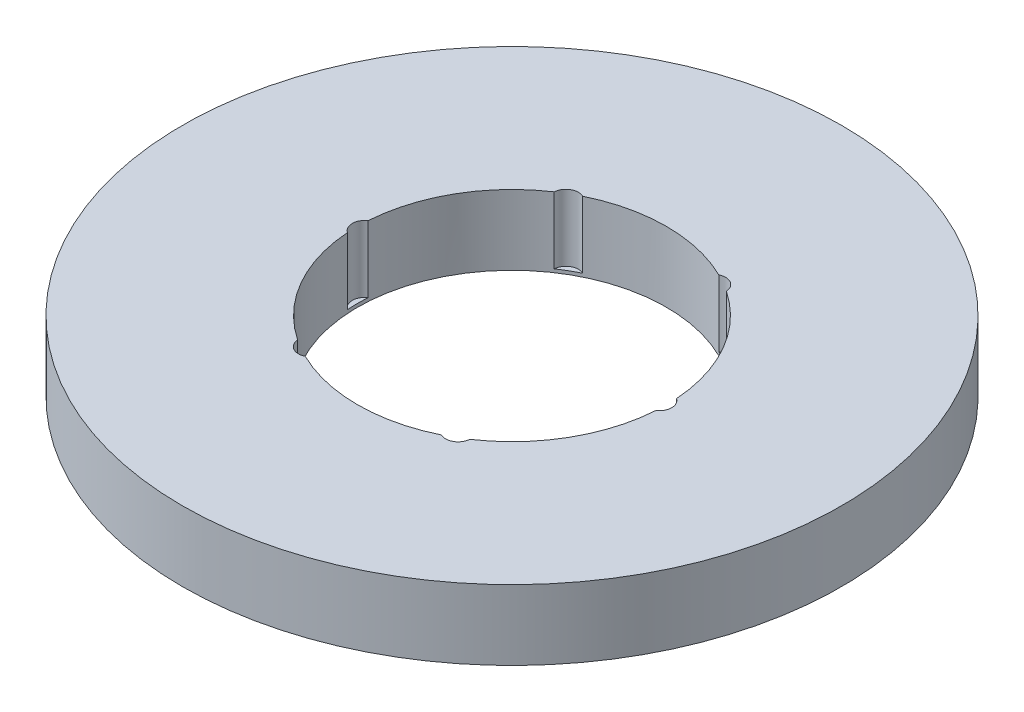
ISO-10303-21;
HEADER;
FILE_DESCRIPTION(('STEP AP214'),'2;1');
FILE_NAME('part.step','',(''),(''),'','','');
FILE_SCHEMA(('AUTOMOTIVE_DESIGN { 1 0 10303 214 1 1 1 1 }'));
ENDSEC;
DATA;
#1=APPLICATION_CONTEXT('core data for automotive mechanical design processes');
#2=APPLICATION_PROTOCOL_DEFINITION('international standard','automotive_design',2000,#1);
#3=PRODUCT_CONTEXT('',#1,'mechanical');
#4=PRODUCT('Part','Part','',(#3));
#5=PRODUCT_RELATED_PRODUCT_CATEGORY('part','',(#4));
#6=PRODUCT_DEFINITION_FORMATION('','',#4);
#7=PRODUCT_DEFINITION_CONTEXT('part definition',#1,'design');
#8=PRODUCT_DEFINITION('design','',#6,#7);
#9=PRODUCT_DEFINITION_SHAPE('','',#8);
#10=(LENGTH_UNIT() NAMED_UNIT(*) SI_UNIT(.MILLI.,.METRE.));
#11=(NAMED_UNIT(*) PLANE_ANGLE_UNIT() SI_UNIT($,.RADIAN.));
#12=(NAMED_UNIT(*) SI_UNIT($,.STERADIAN.) SOLID_ANGLE_UNIT());
#13=UNCERTAINTY_MEASURE_WITH_UNIT(LENGTH_MEASURE(1.E-05),#10,'distance_accuracy_value','');
#14=(GEOMETRIC_REPRESENTATION_CONTEXT(3) GLOBAL_UNCERTAINTY_ASSIGNED_CONTEXT((#13)) GLOBAL_UNIT_ASSIGNED_CONTEXT((#10,
#11,#12)) REPRESENTATION_CONTEXT('',''));
#15=CARTESIAN_POINT('',(0.,0.,0.));
#16=DIRECTION('',(0.,0.,1.));
#17=DIRECTION('',(1.,0.,0.));
#18=AXIS2_PLACEMENT_3D('',#15,#16,#17);
#19=CARTESIAN_POINT('',(0.,17.,0.));
#20=DIRECTION('',(0.,-1.,0.));
#21=DIRECTION('',(0.,0.,-1.));
#22=AXIS2_PLACEMENT_3D('',#19,#20,#21);
#23=CYLINDRICAL_SURFACE('',#22,80.);
#24=CARTESIAN_POINT('',(0.,17.,0.));
#25=DIRECTION('',(0.,1.,0.));
#26=DIRECTION('',(0.,0.,1.));
#27=AXIS2_PLACEMENT_3D('',#24,#25,#26);
#28=CIRCLE('',#27,80.);
#29=CARTESIAN_POINT('',(0.,17.,80.));
#30=VERTEX_POINT('',#29);
#31=EDGE_CURVE('E162',#30,#30,#28,.T.);
#32=ORIENTED_EDGE('',*,*,#31,.F.);
#33=EDGE_LOOP('',(#32));
#34=FACE_BOUND('',#33,.T.);
#35=CARTESIAN_POINT('',(0.,0.,0.));
#36=DIRECTION('',(0.,1.,0.));
#37=DIRECTION('',(0.,0.,1.));
#38=AXIS2_PLACEMENT_3D('',#35,#36,#37);
#39=CIRCLE('',#38,80.);
#40=CARTESIAN_POINT('',(0.,0.,80.));
#41=VERTEX_POINT('',#40);
#42=EDGE_CURVE('E157',#41,#41,#39,.T.);
#43=ORIENTED_EDGE('',*,*,#42,.T.);
#44=EDGE_LOOP('',(#43));
#45=FACE_BOUND('',#44,.T.);
#46=ADVANCED_FACE('F39',(#34,#45),#23,.T.);
#47=CARTESIAN_POINT('',(0.,17.,0.));
#48=DIRECTION('',(0.,1.,0.));
#49=DIRECTION('',(0.,0.,1.));
#50=AXIS2_PLACEMENT_3D('',#47,#48,#49);
#51=PLANE('',#50);
#52=CARTESIAN_POINT('',(-17.8663865016126,17.,-30.945489168455));
#53=DIRECTION('',(0.,1.,0.));
#54=DIRECTION('',(-0.866025403784433,0.,0.50000000000001));
#55=AXIS2_PLACEMENT_3D('',#52,#53,#54);
#56=CIRCLE('',#55,3.02806501759996);
#57=CARTESIAN_POINT('',(-16.5274557995821,17.,-33.661449832009));
#58=VERTEX_POINT('',#57);
#59=CARTESIAN_POINT('',(-20.8879427829449,17.,-31.1439214983666));
#60=VERTEX_POINT('',#59);
#61=EDGE_CURVE('E218',#58,#60,#56,.T.);
#62=ORIENTED_EDGE('',*,*,#61,.F.);
#63=CARTESIAN_POINT('',(0.,17.,0.));
#64=DIRECTION('',(0.,1.,0.));
#65=DIRECTION('',(0.,0.,1.));
#66=AXIS2_PLACEMENT_3D('',#63,#64,#65);
#67=CIRCLE('',#66,37.5);
#68=CARTESIAN_POINT('',(16.5274557995814,17.,-33.6614498320093));
#69=VERTEX_POINT('',#68);
#70=EDGE_CURVE('E169',#69,#58,#67,.T.);
#71=ORIENTED_EDGE('',*,*,#70,.F.);
#72=CARTESIAN_POINT('',(17.866386501612,17.,-30.9454891684553));
#73=DIRECTION('',(0.,1.,0.));
#74=DIRECTION('',(-0.866025403784443,0.,-0.499999999999992));
#75=AXIS2_PLACEMENT_3D('',#72,#73,#74);
#76=CIRCLE('',#75,3.02806501759996);
#77=CARTESIAN_POINT('',(20.8879427829442,17.,-31.143921498367));
#78=VERTEX_POINT('',#77);
#79=EDGE_CURVE('E285',#78,#69,#76,.T.);
#80=ORIENTED_EDGE('',*,*,#79,.F.);
#81=CARTESIAN_POINT('',(37.4153985825263,17.,-2.51752833364235));
#82=VERTEX_POINT('',#81);
#83=EDGE_CURVE('E174',#82,#78,#67,.T.);
#84=ORIENTED_EDGE('',*,*,#83,.F.);
#85=CARTESIAN_POINT('',(35.7327730032245,17.,0.));
#86=DIRECTION('',(0.,1.,0.));
#87=DIRECTION('',(0.,0.,-1.));
#88=AXIS2_PLACEMENT_3D('',#85,#86,#87);
#89=CIRCLE('',#88,3.02806501759996);
#90=CARTESIAN_POINT('',(37.4153985825263,17.,2.51752833364235));
#91=VERTEX_POINT('',#90);
#92=EDGE_CURVE('E280',#91,#82,#89,.T.);
#93=ORIENTED_EDGE('',*,*,#92,.F.);
#94=CARTESIAN_POINT('',(20.8879427829447,17.,31.1439214983667));
#95=VERTEX_POINT('',#94);
#96=EDGE_CURVE('E164',#95,#91,#67,.T.);
#97=ORIENTED_EDGE('',*,*,#96,.F.);
#98=CARTESIAN_POINT('',(17.8663865016124,17.,30.9454891684551));
#99=DIRECTION('',(0.,1.,0.));
#100=DIRECTION('',(0.866025403784436,0.,-0.500000000000004));
#101=AXIS2_PLACEMENT_3D('',#98,#99,#100);
#102=CIRCLE('',#101,3.02806501759996);
#103=CARTESIAN_POINT('',(16.5274557995819,17.,33.6614498320091));
#104=VERTEX_POINT('',#103);
#105=EDGE_CURVE('E269',#104,#95,#102,.T.);
#106=ORIENTED_EDGE('',*,*,#105,.F.);
#107=CARTESIAN_POINT('',(-16.5274557995817,17.,33.6614498320092));
#108=VERTEX_POINT('',#107);
#109=EDGE_CURVE('E149',#108,#104,#67,.T.);
#110=ORIENTED_EDGE('',*,*,#109,.F.);
#111=CARTESIAN_POINT('',(-17.8663865016122,17.,30.9454891684552));
#112=DIRECTION('',(0.,1.,0.));
#113=DIRECTION('',(0.86602540378444,0.,0.499999999999998));
#114=AXIS2_PLACEMENT_3D('',#111,#112,#113);
#115=CIRCLE('',#114,3.02806501759996);
#116=CARTESIAN_POINT('',(-20.8879427829444,17.,31.1439214983669));
#117=VERTEX_POINT('',#116);
#118=EDGE_CURVE('E128',#117,#108,#115,.T.);
#119=ORIENTED_EDGE('',*,*,#118,.F.);
#120=CARTESIAN_POINT('',(-37.4153985825263,17.,2.51752833364235));
#121=VERTEX_POINT('',#120);
#122=EDGE_CURVE('E148',#121,#117,#67,.T.);
#123=ORIENTED_EDGE('',*,*,#122,.F.);
#124=CARTESIAN_POINT('',(-35.7327730032245,17.,0.));
#125=DIRECTION('',(0.,1.,0.));
#126=DIRECTION('',(0.,0.,1.));
#127=AXIS2_PLACEMENT_3D('',#124,#125,#126);
#128=CIRCLE('',#127,3.02806501759996);
#129=CARTESIAN_POINT('',(-37.4153985825263,17.,-2.51752833364235));
#130=VERTEX_POINT('',#129);
#131=EDGE_CURVE('E179',#130,#121,#128,.T.);
#132=ORIENTED_EDGE('',*,*,#131,.F.);
#133=EDGE_CURVE('E161',#60,#130,#67,.T.);
#134=ORIENTED_EDGE('',*,*,#133,.F.);
#135=EDGE_LOOP('',(#62,#71,#80,#84,#93,#97,#106,#110,#119,#123,#132,#134));
#136=FACE_BOUND('',#135,.T.);
#137=ORIENTED_EDGE('',*,*,#31,.T.);
#138=EDGE_LOOP('',(#137));
#139=FACE_BOUND('',#138,.T.);
#140=ADVANCED_FACE('F141',(#136,#139),#51,.T.);
#141=CARTESIAN_POINT('',(0.,0.,0.));
#142=DIRECTION('',(0.,1.,0.));
#143=DIRECTION('',(0.,0.,1.));
#144=AXIS2_PLACEMENT_3D('',#141,#142,#143);
#145=PLANE('',#144);
#146=CARTESIAN_POINT('',(0.,0.,0.));
#147=DIRECTION('',(0.,1.,0.));
#148=DIRECTION('',(0.,0.,1.));
#149=AXIS2_PLACEMENT_3D('',#146,#147,#148);
#150=CIRCLE('',#149,37.5);
#151=CARTESIAN_POINT('',(0.,0.,37.5));
#152=VERTEX_POINT('',#151);
#153=EDGE_CURVE('E166',#152,#152,#150,.T.);
#154=ORIENTED_EDGE('',*,*,#153,.T.);
#155=EDGE_LOOP('',(#154));
#156=FACE_BOUND('',#155,.T.);
#157=ORIENTED_EDGE('',*,*,#42,.F.);
#158=EDGE_LOOP('',(#157));
#159=FACE_BOUND('',#158,.T.);
#160=ADVANCED_FACE('F234',(#156,#159),#145,.F.);
#161=CARTESIAN_POINT('',(0.,17.,0.));
#162=DIRECTION('',(0.,-1.,0.));
#163=DIRECTION('',(0.,0.,-1.));
#164=AXIS2_PLACEMENT_3D('',#161,#162,#163);
#165=CYLINDRICAL_SURFACE('',#164,37.5);
#166=DIRECTION('',(0.,1.,0.));
#167=VECTOR('',#166,1.);
#168=CARTESIAN_POINT('',(-16.5274557995821,8.90569458255693,-33.661449832009));
#169=LINE('',#168,#167);
#170=CARTESIAN_POINT('',(-16.5274557995821,0.811389165113866,-33.661449832009));
#171=VERTEX_POINT('',#170);
#172=EDGE_CURVE('E11',#171,#58,#169,.T.);
#173=ORIENTED_EDGE('',*,*,#172,.F.);
#174=CARTESIAN_POINT('',(0.,0.811389165113866,0.));
#175=DIRECTION('',(0.,1.,0.));
#176=DIRECTION('',(0.,0.,1.));
#177=AXIS2_PLACEMENT_3D('',#174,#175,#176);
#178=CIRCLE('',#177,37.5);
#179=CARTESIAN_POINT('',(-20.8879427829449,0.811389165113866,-31.1439214983666));
#180=VERTEX_POINT('',#179);
#181=EDGE_CURVE('E214',#171,#180,#178,.T.);
#182=ORIENTED_EDGE('',*,*,#181,.T.);
#183=DIRECTION('',(0.,1.,0.));
#184=VECTOR('',#183,1.);
#185=CARTESIAN_POINT('',(-20.8879427829449,8.90569458255693,-31.1439214983666));
#186=LINE('',#185,#184);
#187=EDGE_CURVE('E46',#60,#180,#186,.F.);
#188=ORIENTED_EDGE('',*,*,#187,.F.);
#189=ORIENTED_EDGE('',*,*,#133,.T.);
#190=DIRECTION('',(0.,1.,0.));
#191=VECTOR('',#190,1.);
#192=CARTESIAN_POINT('',(-37.4153985825263,8.90569458255693,-2.51752833364234));
#193=LINE('',#192,#191);
#194=CARTESIAN_POINT('',(-37.4153985825263,0.811389165113866,-2.51752833364235));
#195=VERTEX_POINT('',#194);
#196=EDGE_CURVE('E187',#195,#130,#193,.T.);
#197=ORIENTED_EDGE('',*,*,#196,.F.);
#198=CARTESIAN_POINT('',(0.,0.811389165113866,0.));
#199=DIRECTION('',(0.,1.,0.));
#200=DIRECTION('',(0.,0.,1.));
#201=AXIS2_PLACEMENT_3D('',#198,#199,#200);
#202=CIRCLE('',#201,37.5);
#203=CARTESIAN_POINT('',(-37.4153985825263,0.811389165113866,2.51752833364235));
#204=VERTEX_POINT('',#203);
#205=EDGE_CURVE('E184',#195,#204,#202,.T.);
#206=ORIENTED_EDGE('',*,*,#205,.T.);
#207=DIRECTION('',(0.,1.,0.));
#208=VECTOR('',#207,1.);
#209=CARTESIAN_POINT('',(-37.4153985825263,8.90569458255693,2.51752833364234));
#210=LINE('',#209,#208);
#211=EDGE_CURVE('E158',#121,#204,#210,.F.);
#212=ORIENTED_EDGE('',*,*,#211,.F.);
#213=ORIENTED_EDGE('',*,*,#122,.T.);
#214=DIRECTION('',(0.,1.,0.));
#215=VECTOR('',#214,1.);
#216=CARTESIAN_POINT('',(-20.8879427829444,8.90569458255693,31.1439214983669));
#217=LINE('',#216,#215);
#218=CARTESIAN_POINT('',(-20.8879427829444,0.811389165113866,31.1439214983669));
#219=VERTEX_POINT('',#218);
#220=EDGE_CURVE('E127',#219,#117,#217,.T.);
#221=ORIENTED_EDGE('',*,*,#220,.F.);
#222=CARTESIAN_POINT('',(0.,0.811389165113866,0.));
#223=DIRECTION('',(0.,1.,0.));
#224=DIRECTION('',(0.,0.,1.));
#225=AXIS2_PLACEMENT_3D('',#222,#223,#224);
#226=CIRCLE('',#225,37.5);
#227=CARTESIAN_POINT('',(-16.5274557995817,0.811389165113866,33.6614498320092));
#228=VERTEX_POINT('',#227);
#229=EDGE_CURVE('E189',#219,#228,#226,.T.);
#230=ORIENTED_EDGE('',*,*,#229,.T.);
#231=DIRECTION('',(0.,1.,0.));
#232=VECTOR('',#231,1.);
#233=CARTESIAN_POINT('',(-16.5274557995817,8.90569458255693,33.6614498320092));
#234=LINE('',#233,#232);
#235=EDGE_CURVE('E140',#108,#228,#234,.F.);
#236=ORIENTED_EDGE('',*,*,#235,.F.);
#237=ORIENTED_EDGE('',*,*,#109,.T.);
#238=DIRECTION('',(0.,1.,0.));
#239=VECTOR('',#238,1.);
#240=CARTESIAN_POINT('',(16.5274557995819,8.90569458255693,33.6614498320091));
#241=LINE('',#240,#239);
#242=CARTESIAN_POINT('',(16.5274557995819,0.811389165113866,33.6614498320091));
#243=VERTEX_POINT('',#242);
#244=EDGE_CURVE('E196',#243,#104,#241,.T.);
#245=ORIENTED_EDGE('',*,*,#244,.F.);
#246=CARTESIAN_POINT('',(0.,0.811389165113866,0.));
#247=DIRECTION('',(0.,1.,0.));
#248=DIRECTION('',(0.,0.,1.));
#249=AXIS2_PLACEMENT_3D('',#246,#247,#248);
#250=CIRCLE('',#249,37.5);
#251=CARTESIAN_POINT('',(20.8879427829447,0.811389165113866,31.1439214983667));
#252=VERTEX_POINT('',#251);
#253=EDGE_CURVE('E136',#243,#252,#250,.T.);
#254=ORIENTED_EDGE('',*,*,#253,.T.);
#255=DIRECTION('',(0.,1.,0.));
#256=VECTOR('',#255,1.);
#257=CARTESIAN_POINT('',(20.8879427829447,8.90569458255693,31.1439214983668));
#258=LINE('',#257,#256);
#259=EDGE_CURVE('E194',#95,#252,#258,.F.);
#260=ORIENTED_EDGE('',*,*,#259,.F.);
#261=ORIENTED_EDGE('',*,*,#96,.T.);
#262=DIRECTION('',(0.,1.,0.));
#263=VECTOR('',#262,1.);
#264=CARTESIAN_POINT('',(37.4153985825263,8.90569458255693,2.51752833364234));
#265=LINE('',#264,#263);
#266=CARTESIAN_POINT('',(37.4153985825263,0.811389165113866,2.51752833364235));
#267=VERTEX_POINT('',#266);
#268=EDGE_CURVE('E206',#267,#91,#265,.T.);
#269=ORIENTED_EDGE('',*,*,#268,.F.);
#270=CARTESIAN_POINT('',(0.,0.811389165113866,0.));
#271=DIRECTION('',(0.,1.,0.));
#272=DIRECTION('',(0.,0.,1.));
#273=AXIS2_PLACEMENT_3D('',#270,#271,#272);
#274=CIRCLE('',#273,37.5);
#275=CARTESIAN_POINT('',(37.4153985825263,0.811389165113866,-2.51752833364235));
#276=VERTEX_POINT('',#275);
#277=EDGE_CURVE('E199',#267,#276,#274,.T.);
#278=ORIENTED_EDGE('',*,*,#277,.T.);
#279=DIRECTION('',(0.,1.,0.));
#280=VECTOR('',#279,1.);
#281=CARTESIAN_POINT('',(37.4153985825263,8.90569458255693,-2.51752833364234));
#282=LINE('',#281,#280);
#283=EDGE_CURVE('E201',#82,#276,#282,.F.);
#284=ORIENTED_EDGE('',*,*,#283,.F.);
#285=ORIENTED_EDGE('',*,*,#83,.T.);
#286=DIRECTION('',(0.,1.,0.));
#287=VECTOR('',#286,1.);
#288=CARTESIAN_POINT('',(20.8879427829442,8.90569458255693,-31.1439214983671));
#289=LINE('',#288,#287);
#290=CARTESIAN_POINT('',(20.8879427829442,0.811389165113866,-31.143921498367));
#291=VERTEX_POINT('',#290);
#292=EDGE_CURVE('E213',#291,#78,#289,.T.);
#293=ORIENTED_EDGE('',*,*,#292,.F.);
#294=CARTESIAN_POINT('',(0.,0.811389165113866,0.));
#295=DIRECTION('',(0.,1.,0.));
#296=DIRECTION('',(0.,0.,1.));
#297=AXIS2_PLACEMENT_3D('',#294,#295,#296);
#298=CIRCLE('',#297,37.5);
#299=CARTESIAN_POINT('',(16.5274557995814,0.811389165113866,-33.6614498320093));
#300=VERTEX_POINT('',#299);
#301=EDGE_CURVE('E208',#291,#300,#298,.T.);
#302=ORIENTED_EDGE('',*,*,#301,.T.);
#303=DIRECTION('',(0.,1.,0.));
#304=VECTOR('',#303,1.);
#305=CARTESIAN_POINT('',(16.5274557995814,8.90569458255693,-33.6614498320094));
#306=LINE('',#305,#304);
#307=EDGE_CURVE('E211',#69,#300,#306,.F.);
#308=ORIENTED_EDGE('',*,*,#307,.F.);
#309=ORIENTED_EDGE('',*,*,#70,.T.);
#310=EDGE_LOOP('',(#173,#182,#188,#189,#197,#206,#212,#213,#221,#230,#236,#237,#245,#254,#260,
#261,#269,#278,#284,#285,#293,#302,#308,#309));
#311=FACE_BOUND('',#310,.T.);
#312=ORIENTED_EDGE('',*,*,#153,.F.);
#313=EDGE_LOOP('',(#312));
#314=FACE_BOUND('',#313,.T.);
#315=ADVANCED_FACE('F152',(#311,#314),#165,.F.);
#316=CARTESIAN_POINT('',(-35.7327730032245,0.811389165113866,0.));
#317=DIRECTION('',(0.,1.,0.));
#318=DIRECTION('',(0.,0.,1.));
#319=AXIS2_PLACEMENT_3D('',#316,#317,#318);
#320=CYLINDRICAL_SURFACE('',#319,3.02806501759996);
#321=ORIENTED_EDGE('',*,*,#196,.T.);
#322=ORIENTED_EDGE('',*,*,#131,.T.);
#323=ORIENTED_EDGE('',*,*,#211,.T.);
#324=CARTESIAN_POINT('',(-35.7327730032245,0.811389165113866,0.));
#325=DIRECTION('',(0.,1.,0.));
#326=DIRECTION('',(0.,0.,1.));
#327=AXIS2_PLACEMENT_3D('',#324,#325,#326);
#328=CIRCLE('',#327,3.02806501759996);
#329=EDGE_CURVE('E180',#195,#204,#328,.T.);
#330=ORIENTED_EDGE('',*,*,#329,.F.);
#331=EDGE_LOOP('',(#321,#322,#323,#330));
#332=FACE_BOUND('',#331,.T.);
#333=ADVANCED_FACE('F244',(#332),#320,.F.);
#334=CARTESIAN_POINT('',(-35.7327730032245,0.811389165113866,0.));
#335=DIRECTION('',(0.,1.,0.));
#336=DIRECTION('',(0.,0.,1.));
#337=AXIS2_PLACEMENT_3D('',#334,#335,#336);
#338=PLANE('',#337);
#339=ORIENTED_EDGE('',*,*,#329,.T.);
#340=ORIENTED_EDGE('',*,*,#205,.F.);
#341=EDGE_LOOP('',(#339,#340));
#342=FACE_BOUND('',#341,.T.);
#343=ADVANCED_FACE('F248',(#342),#338,.T.);
#344=CARTESIAN_POINT('',(-17.8663865016122,0.811389165113866,30.9454891684552));
#345=DIRECTION('',(0.,1.,0.));
#346=DIRECTION('',(0.,0.,1.));
#347=AXIS2_PLACEMENT_3D('',#344,#345,#346);
#348=CYLINDRICAL_SURFACE('',#347,3.02806501759996);
#349=ORIENTED_EDGE('',*,*,#220,.T.);
#350=ORIENTED_EDGE('',*,*,#118,.T.);
#351=ORIENTED_EDGE('',*,*,#235,.T.);
#352=CARTESIAN_POINT('',(-17.8663865016122,0.811389165113866,30.9454891684552));
#353=DIRECTION('',(0.,1.,0.));
#354=DIRECTION('',(0.86602540378444,0.,0.499999999999998));
#355=AXIS2_PLACEMENT_3D('',#352,#353,#354);
#356=CIRCLE('',#355,3.02806501759996);
#357=EDGE_CURVE('E135',#219,#228,#356,.T.);
#358=ORIENTED_EDGE('',*,*,#357,.F.);
#359=EDGE_LOOP('',(#349,#350,#351,#358));
#360=FACE_BOUND('',#359,.T.);
#361=ADVANCED_FACE('F126',(#360),#348,.F.);
#362=CARTESIAN_POINT('',(-17.8663865016122,0.811389165113866,30.9454891684552));
#363=DIRECTION('',(0.,1.,0.));
#364=DIRECTION('',(0.86602540378444,0.,0.499999999999998));
#365=AXIS2_PLACEMENT_3D('',#362,#363,#364);
#366=PLANE('',#365);
#367=ORIENTED_EDGE('',*,*,#357,.T.);
#368=ORIENTED_EDGE('',*,*,#229,.F.);
#369=EDGE_LOOP('',(#367,#368));
#370=FACE_BOUND('',#369,.T.);
#371=ADVANCED_FACE('F258',(#370),#366,.T.);
#372=CARTESIAN_POINT('',(17.8663865016124,0.811389165113866,30.9454891684551));
#373=DIRECTION('',(0.,1.,0.));
#374=DIRECTION('',(0.,0.,1.));
#375=AXIS2_PLACEMENT_3D('',#372,#373,#374);
#376=CYLINDRICAL_SURFACE('',#375,3.02806501759996);
#377=ORIENTED_EDGE('',*,*,#244,.T.);
#378=ORIENTED_EDGE('',*,*,#105,.T.);
#379=ORIENTED_EDGE('',*,*,#259,.T.);
#380=CARTESIAN_POINT('',(17.8663865016124,0.811389165113866,30.9454891684551));
#381=DIRECTION('',(0.,1.,0.));
#382=DIRECTION('',(0.866025403784436,0.,-0.500000000000004));
#383=AXIS2_PLACEMENT_3D('',#380,#381,#382);
#384=CIRCLE('',#383,3.02806501759996);
#385=EDGE_CURVE('E147',#243,#252,#384,.T.);
#386=ORIENTED_EDGE('',*,*,#385,.F.);
#387=EDGE_LOOP('',(#377,#378,#379,#386));
#388=FACE_BOUND('',#387,.T.);
#389=ADVANCED_FACE('F256',(#388),#376,.F.);
#390=CARTESIAN_POINT('',(17.8663865016124,0.811389165113866,30.9454891684551));
#391=DIRECTION('',(0.,1.,0.));
#392=DIRECTION('',(0.866025403784436,0.,-0.500000000000004));
#393=AXIS2_PLACEMENT_3D('',#390,#391,#392);
#394=PLANE('',#393);
#395=ORIENTED_EDGE('',*,*,#385,.T.);
#396=ORIENTED_EDGE('',*,*,#253,.F.);
#397=EDGE_LOOP('',(#395,#396));
#398=FACE_BOUND('',#397,.T.);
#399=ADVANCED_FACE('F263',(#398),#394,.T.);
#400=CARTESIAN_POINT('',(35.7327730032245,0.811389165113866,0.));
#401=DIRECTION('',(0.,1.,0.));
#402=DIRECTION('',(0.,0.,1.));
#403=AXIS2_PLACEMENT_3D('',#400,#401,#402);
#404=CYLINDRICAL_SURFACE('',#403,3.02806501759996);
#405=ORIENTED_EDGE('',*,*,#268,.T.);
#406=ORIENTED_EDGE('',*,*,#92,.T.);
#407=ORIENTED_EDGE('',*,*,#283,.T.);
#408=CARTESIAN_POINT('',(35.7327730032245,0.811389165113866,0.));
#409=DIRECTION('',(0.,1.,0.));
#410=DIRECTION('',(0.,0.,-1.));
#411=AXIS2_PLACEMENT_3D('',#408,#409,#410);
#412=CIRCLE('',#411,3.02806501759996);
#413=EDGE_CURVE('E273',#267,#276,#412,.T.);
#414=ORIENTED_EDGE('',*,*,#413,.F.);
#415=EDGE_LOOP('',(#405,#406,#407,#414));
#416=FACE_BOUND('',#415,.T.);
#417=ADVANCED_FACE('F297',(#416),#404,.F.);
#418=CARTESIAN_POINT('',(35.7327730032245,0.811389165113866,0.));
#419=DIRECTION('',(0.,1.,0.));
#420=DIRECTION('',(0.,0.,-1.));
#421=AXIS2_PLACEMENT_3D('',#418,#419,#420);
#422=PLANE('',#421);
#423=ORIENTED_EDGE('',*,*,#413,.T.);
#424=ORIENTED_EDGE('',*,*,#277,.F.);
#425=EDGE_LOOP('',(#423,#424));
#426=FACE_BOUND('',#425,.T.);
#427=ADVANCED_FACE('F299',(#426),#422,.T.);
#428=CARTESIAN_POINT('',(17.866386501612,0.811389165113866,-30.9454891684553));
#429=DIRECTION('',(0.,1.,0.));
#430=DIRECTION('',(0.,0.,1.));
#431=AXIS2_PLACEMENT_3D('',#428,#429,#430);
#432=CYLINDRICAL_SURFACE('',#431,3.02806501759996);
#433=ORIENTED_EDGE('',*,*,#292,.T.);
#434=ORIENTED_EDGE('',*,*,#79,.T.);
#435=ORIENTED_EDGE('',*,*,#307,.T.);
#436=CARTESIAN_POINT('',(17.866386501612,0.811389165113866,-30.9454891684553));
#437=DIRECTION('',(0.,1.,0.));
#438=DIRECTION('',(-0.866025403784443,0.,-0.499999999999992));
#439=AXIS2_PLACEMENT_3D('',#436,#437,#438);
#440=CIRCLE('',#439,3.02806501759996);
#441=EDGE_CURVE('E56',#291,#300,#440,.T.);
#442=ORIENTED_EDGE('',*,*,#441,.F.);
#443=EDGE_LOOP('',(#433,#434,#435,#442));
#444=FACE_BOUND('',#443,.T.);
#445=ADVANCED_FACE('F292',(#444),#432,.F.);
#446=CARTESIAN_POINT('',(17.866386501612,0.811389165113866,-30.9454891684553));
#447=DIRECTION('',(0.,1.,0.));
#448=DIRECTION('',(-0.866025403784443,0.,-0.499999999999992));
#449=AXIS2_PLACEMENT_3D('',#446,#447,#448);
#450=PLANE('',#449);
#451=ORIENTED_EDGE('',*,*,#441,.T.);
#452=ORIENTED_EDGE('',*,*,#301,.F.);
#453=EDGE_LOOP('',(#451,#452));
#454=FACE_BOUND('',#453,.T.);
#455=ADVANCED_FACE('F226',(#454),#450,.T.);
#456=CARTESIAN_POINT('',(-17.8663865016126,0.811389165113866,-30.945489168455));
#457=DIRECTION('',(0.,1.,0.));
#458=DIRECTION('',(0.,0.,1.));
#459=AXIS2_PLACEMENT_3D('',#456,#457,#458);
#460=CYLINDRICAL_SURFACE('',#459,3.02806501759996);
#461=ORIENTED_EDGE('',*,*,#172,.T.);
#462=ORIENTED_EDGE('',*,*,#61,.T.);
#463=ORIENTED_EDGE('',*,*,#187,.T.);
#464=CARTESIAN_POINT('',(-17.8663865016126,0.811389165113866,-30.945489168455));
#465=DIRECTION('',(0.,1.,0.));
#466=DIRECTION('',(-0.866025403784433,0.,0.50000000000001));
#467=AXIS2_PLACEMENT_3D('',#464,#465,#466);
#468=CIRCLE('',#467,3.02806501759996);
#469=EDGE_CURVE('E55',#171,#180,#468,.T.);
#470=ORIENTED_EDGE('',*,*,#469,.F.);
#471=EDGE_LOOP('',(#461,#462,#463,#470));
#472=FACE_BOUND('',#471,.T.);
#473=ADVANCED_FACE('F217',(#472),#460,.F.);
#474=CARTESIAN_POINT('',(-17.8663865016126,0.811389165113866,-30.945489168455));
#475=DIRECTION('',(0.,1.,0.));
#476=DIRECTION('',(-0.866025403784433,0.,0.50000000000001));
#477=AXIS2_PLACEMENT_3D('',#474,#475,#476);
#478=PLANE('',#477);
#479=ORIENTED_EDGE('',*,*,#469,.T.);
#480=ORIENTED_EDGE('',*,*,#181,.F.);
#481=EDGE_LOOP('',(#479,#480));
#482=FACE_BOUND('',#481,.T.);
#483=ADVANCED_FACE('F219',(#482),#478,.T.);
#484=CLOSED_SHELL('',(#46,#140,#160,#315,#333,#343,#361,#371,#389,#399,#417,#427,#445,#455,#473,#483));
#485=MANIFOLD_SOLID_BREP('B2',#484);
#486=ADVANCED_BREP_SHAPE_REPRESENTATION('',(#18,#485),#14);
#487=SHAPE_DEFINITION_REPRESENTATION(#9,#486);
ENDSEC;
END-ISO-10303-21;
